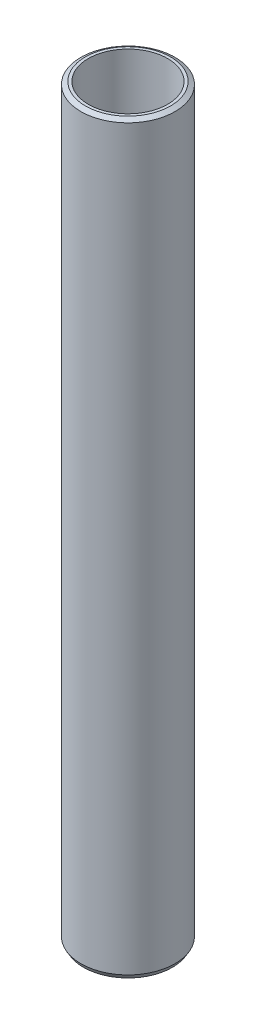
ISO-10303-21;
HEADER;
FILE_DESCRIPTION(('STEP AP214'),'2;1');
FILE_NAME('part.step','',(''),(''),'','','');
FILE_SCHEMA(('AUTOMOTIVE_DESIGN { 1 0 10303 214 1 1 1 1 }'));
ENDSEC;
DATA;
#1=APPLICATION_CONTEXT('core data for automotive mechanical design processes');
#2=APPLICATION_PROTOCOL_DEFINITION('international standard','automotive_design',2000,#1);
#3=PRODUCT_CONTEXT('',#1,'mechanical');
#4=PRODUCT('Part','Part','',(#3));
#5=PRODUCT_RELATED_PRODUCT_CATEGORY('part','',(#4));
#6=PRODUCT_DEFINITION_FORMATION('','',#4);
#7=PRODUCT_DEFINITION_CONTEXT('part definition',#1,'design');
#8=PRODUCT_DEFINITION('design','',#6,#7);
#9=PRODUCT_DEFINITION_SHAPE('','',#8);
#10=(LENGTH_UNIT() NAMED_UNIT(*) SI_UNIT(.MILLI.,.METRE.));
#11=(NAMED_UNIT(*) PLANE_ANGLE_UNIT() SI_UNIT($,.RADIAN.));
#12=(NAMED_UNIT(*) SI_UNIT($,.STERADIAN.) SOLID_ANGLE_UNIT());
#13=UNCERTAINTY_MEASURE_WITH_UNIT(LENGTH_MEASURE(1.E-05),#10,'distance_accuracy_value','');
#14=(GEOMETRIC_REPRESENTATION_CONTEXT(3) GLOBAL_UNCERTAINTY_ASSIGNED_CONTEXT((#13)) GLOBAL_UNIT_ASSIGNED_CONTEXT((#10,
#11,#12)) REPRESENTATION_CONTEXT('',''));
#15=CARTESIAN_POINT('',(0.,0.,0.));
#16=DIRECTION('',(0.,0.,1.));
#17=DIRECTION('',(1.,0.,0.));
#18=AXIS2_PLACEMENT_3D('',#15,#16,#17);
#19=CARTESIAN_POINT('',(0.,554.018841921218,0.));
#20=DIRECTION('',(0.,-1.,0.));
#21=DIRECTION('',(0.,0.,-1.));
#22=AXIS2_PLACEMENT_3D('',#19,#20,#21);
#23=CYLINDRICAL_SURFACE('',#22,35.);
#24=CARTESIAN_POINT('',(0.,552.083282734554,0.));
#25=DIRECTION('',(0.,1.,0.));
#26=DIRECTION('',(0.,0.,1.));
#27=AXIS2_PLACEMENT_3D('',#24,#25,#26);
#28=CIRCLE('',#27,35.);
#29=CARTESIAN_POINT('',(0.,552.083282734554,35.));
#30=VERTEX_POINT('',#29);
#31=EDGE_CURVE('E50',#30,#30,#28,.F.);
#32=ORIENTED_EDGE('',*,*,#31,.T.);
#33=EDGE_LOOP('',(#32));
#34=FACE_BOUND('',#33,.T.);
#35=CARTESIAN_POINT('',(0.,3.352486852359,0.));
#36=DIRECTION('',(0.,1.,0.));
#37=DIRECTION('',(0.,0.,1.));
#38=AXIS2_PLACEMENT_3D('',#35,#36,#37);
#39=CIRCLE('',#38,35.);
#40=CARTESIAN_POINT('',(0.,3.352486852359,35.));
#41=VERTEX_POINT('',#40);
#42=EDGE_CURVE('E51',#41,#41,#39,.T.);
#43=ORIENTED_EDGE('',*,*,#42,.T.);
#44=EDGE_LOOP('',(#43));
#45=FACE_BOUND('',#44,.T.);
#46=ADVANCED_FACE('F39',(#34,#45),#23,.T.);
#47=CARTESIAN_POINT('',(0.,554.018841921218,0.));
#48=DIRECTION('',(0.,1.,0.));
#49=DIRECTION('',(0.,0.,1.));
#50=AXIS2_PLACEMENT_3D('',#47,#48,#49);
#51=PLANE('',#50);
#52=CARTESIAN_POINT('',(0.,554.018841921218,0.));
#53=DIRECTION('',(0.,1.,0.));
#54=DIRECTION('',(0.,0.,1.));
#55=AXIS2_PLACEMENT_3D('',#52,#53,#54);
#56=CIRCLE('',#55,31.6475131476409);
#57=CARTESIAN_POINT('',(0.,554.018841921218,31.6475131476409));
#58=VERTEX_POINT('',#57);
#59=EDGE_CURVE('E54',#58,#58,#56,.T.);
#60=ORIENTED_EDGE('',*,*,#59,.T.);
#61=EDGE_LOOP('',(#60));
#62=FACE_BOUND('',#61,.T.);
#63=CARTESIAN_POINT('',(0.,554.018841921218,0.));
#64=DIRECTION('',(0.,1.,0.));
#65=DIRECTION('',(0.,0.,1.));
#66=AXIS2_PLACEMENT_3D('',#63,#64,#65);
#67=CIRCLE('',#66,29.5141916037106);
#68=CARTESIAN_POINT('',(0.,554.018841921218,29.5141916037106));
#69=VERTEX_POINT('',#68);
#70=EDGE_CURVE('E58',#69,#69,#67,.T.);
#71=ORIENTED_EDGE('',*,*,#70,.F.);
#72=EDGE_LOOP('',(#71));
#73=FACE_BOUND('',#72,.T.);
#74=ADVANCED_FACE('F69',(#62,#73),#51,.T.);
#75=CARTESIAN_POINT('',(0.,0.,0.));
#76=DIRECTION('',(0.,1.,0.));
#77=DIRECTION('',(0.,0.,1.));
#78=AXIS2_PLACEMENT_3D('',#75,#76,#77);
#79=PLANE('',#78);
#80=CARTESIAN_POINT('',(0.,0.,0.));
#81=DIRECTION('',(0.,1.,0.));
#82=DIRECTION('',(0.,0.,1.));
#83=AXIS2_PLACEMENT_3D('',#80,#81,#82);
#84=CIRCLE('',#83,33.0644408133359);
#85=CARTESIAN_POINT('',(0.,0.,33.0644408133359));
#86=VERTEX_POINT('',#85);
#87=EDGE_CURVE('E10',#86,#86,#84,.F.);
#88=ORIENTED_EDGE('',*,*,#87,.T.);
#89=EDGE_LOOP('',(#88));
#90=FACE_BOUND('',#89,.T.);
#91=CARTESIAN_POINT('',(0.,0.,0.));
#92=DIRECTION('',(0.,1.,0.));
#93=DIRECTION('',(0.,0.,1.));
#94=AXIS2_PLACEMENT_3D('',#91,#92,#93);
#95=CIRCLE('',#94,29.5141916037106);
#96=CARTESIAN_POINT('',(0.,0.,29.5141916037106));
#97=VERTEX_POINT('',#96);
#98=EDGE_CURVE('E63',#97,#97,#95,.T.);
#99=ORIENTED_EDGE('',*,*,#98,.T.);
#100=EDGE_LOOP('',(#99));
#101=FACE_BOUND('',#100,.T.);
#102=ADVANCED_FACE('F75',(#90,#101),#79,.F.);
#103=CARTESIAN_POINT('',(0.,554.018841921218,0.));
#104=DIRECTION('',(0.,-1.,0.));
#105=DIRECTION('',(0.,0.,-1.));
#106=AXIS2_PLACEMENT_3D('',#103,#104,#105);
#107=CYLINDRICAL_SURFACE('',#106,29.5141916037106);
#108=ORIENTED_EDGE('',*,*,#70,.T.);
#109=EDGE_LOOP('',(#108));
#110=FACE_BOUND('',#109,.T.);
#111=ORIENTED_EDGE('',*,*,#98,.F.);
#112=EDGE_LOOP('',(#111));
#113=FACE_BOUND('',#112,.T.);
#114=ADVANCED_FACE('F70',(#110,#113),#107,.F.);
#115=CARTESIAN_POINT('',(0.,554.018841921218,0.));
#116=DIRECTION('',(0.,-1.,0.));
#117=DIRECTION('',(0.,0.,-1.));
#118=AXIS2_PLACEMENT_3D('',#115,#116,#117);
#119=CONICAL_SURFACE('',#118,31.6475131476409,1.0471975511966);
#120=ORIENTED_EDGE('',*,*,#31,.F.);
#121=EDGE_LOOP('',(#120));
#122=FACE_BOUND('',#121,.T.);
#123=ORIENTED_EDGE('',*,*,#59,.F.);
#124=EDGE_LOOP('',(#123));
#125=FACE_BOUND('',#124,.T.);
#126=ADVANCED_FACE('F81',(#122,#125),#119,.T.);
#127=CARTESIAN_POINT('',(0.,3.352486852359,0.));
#128=DIRECTION('',(0.,1.,0.));
#129=DIRECTION('',(0.,0.,1.));
#130=AXIS2_PLACEMENT_3D('',#127,#128,#129);
#131=CONICAL_SURFACE('',#130,35.,0.52359877559829);
#132=ORIENTED_EDGE('',*,*,#87,.F.);
#133=EDGE_LOOP('',(#132));
#134=FACE_BOUND('',#133,.T.);
#135=ORIENTED_EDGE('',*,*,#42,.F.);
#136=EDGE_LOOP('',(#135));
#137=FACE_BOUND('',#136,.T.);
#138=ADVANCED_FACE('F45',(#134,#137),#131,.T.);
#139=CLOSED_SHELL('',(#46,#74,#102,#114,#126,#138));
#140=MANIFOLD_SOLID_BREP('B2',#139);
#141=ADVANCED_BREP_SHAPE_REPRESENTATION('',(#18,#140),#14);
#142=SHAPE_DEFINITION_REPRESENTATION(#9,#141);
ENDSEC;
END-ISO-10303-21;
